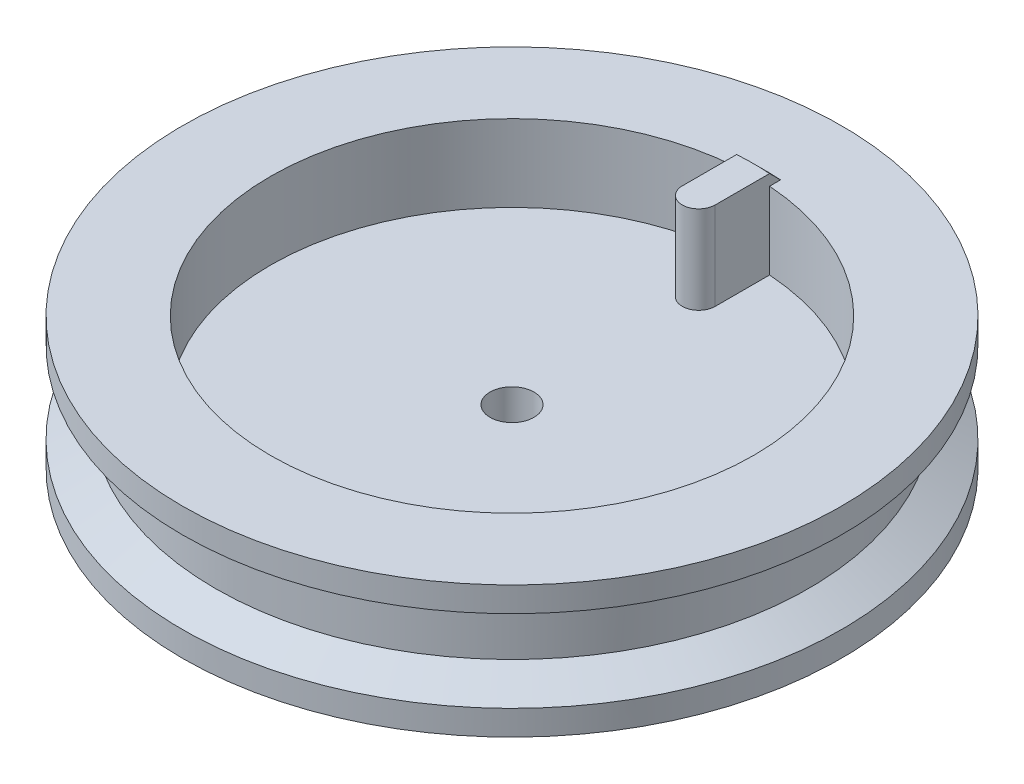
ISO-10303-21;
HEADER;
FILE_DESCRIPTION(('STEP AP214'),'2;1');
FILE_NAME('part.step','',(''),(''),'','','');
FILE_SCHEMA(('AUTOMOTIVE_DESIGN { 1 0 10303 214 1 1 1 1 }'));
ENDSEC;
DATA;
#1=APPLICATION_CONTEXT('core data for automotive mechanical design processes');
#2=APPLICATION_PROTOCOL_DEFINITION('international standard','automotive_design',2000,#1);
#3=PRODUCT_CONTEXT('',#1,'mechanical');
#4=PRODUCT('Part','Part','',(#3));
#5=PRODUCT_RELATED_PRODUCT_CATEGORY('part','',(#4));
#6=PRODUCT_DEFINITION_FORMATION('','',#4);
#7=PRODUCT_DEFINITION_CONTEXT('part definition',#1,'design');
#8=PRODUCT_DEFINITION('design','',#6,#7);
#9=PRODUCT_DEFINITION_SHAPE('','',#8);
#10=(LENGTH_UNIT() NAMED_UNIT(*) SI_UNIT(.MILLI.,.METRE.));
#11=(NAMED_UNIT(*) PLANE_ANGLE_UNIT() SI_UNIT($,.RADIAN.));
#12=(NAMED_UNIT(*) SI_UNIT($,.STERADIAN.) SOLID_ANGLE_UNIT());
#13=UNCERTAINTY_MEASURE_WITH_UNIT(LENGTH_MEASURE(1.E-05),#10,'distance_accuracy_value','');
#14=(GEOMETRIC_REPRESENTATION_CONTEXT(3) GLOBAL_UNCERTAINTY_ASSIGNED_CONTEXT((#13)) GLOBAL_UNIT_ASSIGNED_CONTEXT((#10,
#11,#12)) REPRESENTATION_CONTEXT('',''));
#15=CARTESIAN_POINT('',(0.,0.,0.));
#16=DIRECTION('',(0.,0.,1.));
#17=DIRECTION('',(1.,0.,0.));
#18=AXIS2_PLACEMENT_3D('',#15,#16,#17);
#19=CARTESIAN_POINT('',(0.,-62.2253967444162,0.));
#20=DIRECTION('',(0.,1.,0.));
#21=DIRECTION('',(0.,0.,1.));
#22=AXIS2_PLACEMENT_3D('',#19,#20,#21);
#23=CYLINDRICAL_SURFACE('',#22,22.);
#24=DIRECTION('',(0.,-1.,0.));
#25=VECTOR('',#24,1.);
#26=CARTESIAN_POINT('',(1.5,13.,-21.948804067648));
#27=LINE('',#26,#25);
#28=CARTESIAN_POINT('',(1.5,12.,-21.948804067648));
#29=VERTEX_POINT('',#28);
#30=CARTESIAN_POINT('',(1.5,5.,-21.948804067648));
#31=VERTEX_POINT('',#30);
#32=EDGE_CURVE('E119',#29,#31,#27,.T.);
#33=ORIENTED_EDGE('',*,*,#32,.T.);
#34=CARTESIAN_POINT('',(0.,5.,0.));
#35=DIRECTION('',(0.,1.,0.));
#36=DIRECTION('',(0.,0.,1.));
#37=AXIS2_PLACEMENT_3D('',#34,#35,#36);
#38=CIRCLE('',#37,22.);
#39=CARTESIAN_POINT('',(-1.5,5.,-21.948804067648));
#40=VERTEX_POINT('',#39);
#41=EDGE_CURVE('E155',#31,#40,#38,.F.);
#42=ORIENTED_EDGE('',*,*,#41,.T.);
#43=DIRECTION('',(0.,-1.,0.));
#44=VECTOR('',#43,1.);
#45=CARTESIAN_POINT('',(-1.5,13.,-21.948804067648));
#46=LINE('',#45,#44);
#47=CARTESIAN_POINT('',(-1.5,12.,-21.948804067648));
#48=VERTEX_POINT('',#47);
#49=EDGE_CURVE('E127',#48,#40,#46,.T.);
#50=ORIENTED_EDGE('',*,*,#49,.F.);
#51=CARTESIAN_POINT('',(0.,12.,0.));
#52=DIRECTION('',(0.,1.,0.));
#53=DIRECTION('',(0.,0.,1.));
#54=AXIS2_PLACEMENT_3D('',#51,#52,#53);
#55=CIRCLE('',#54,22.);
#56=EDGE_CURVE('E110',#48,#29,#55,.T.);
#57=ORIENTED_EDGE('',*,*,#56,.T.);
#58=EDGE_LOOP('',(#33,#42,#50,#57));
#59=FACE_BOUND('',#58,.T.);
#60=ADVANCED_FACE('F54',(#59),#23,.F.);
#61=CARTESIAN_POINT('',(0.,5.,0.));
#62=DIRECTION('',(0.,1.,0.));
#63=DIRECTION('',(0.,0.,1.));
#64=AXIS2_PLACEMENT_3D('',#61,#62,#63);
#65=PLANE('',#64);
#66=CARTESIAN_POINT('',(0.,5.,0.));
#67=DIRECTION('',(0.,1.,0.));
#68=DIRECTION('',(0.,0.,1.));
#69=AXIS2_PLACEMENT_3D('',#66,#67,#68);
#70=CIRCLE('',#69,2.);
#71=CARTESIAN_POINT('',(0.,5.,2.));
#72=VERTEX_POINT('',#71);
#73=EDGE_CURVE('E157',#72,#72,#70,.T.);
#74=ORIENTED_EDGE('',*,*,#73,.F.);
#75=EDGE_LOOP('',(#74));
#76=FACE_BOUND('',#75,.T.);
#77=ORIENTED_EDGE('',*,*,#41,.F.);
#78=DIRECTION('',(0.,0.,-1.));
#79=VECTOR('',#78,1.);
#80=CARTESIAN_POINT('',(1.5,5.,0.));
#81=LINE('',#80,#79);
#82=CARTESIAN_POINT('',(1.5,5.,-17.));
#83=VERTEX_POINT('',#82);
#84=EDGE_CURVE('E122',#83,#31,#81,.T.);
#85=ORIENTED_EDGE('',*,*,#84,.F.);
#86=CARTESIAN_POINT('',(0.,5.,-17.));
#87=DIRECTION('',(0.,1.,0.));
#88=DIRECTION('',(0.,0.,1.));
#89=AXIS2_PLACEMENT_3D('',#86,#87,#88);
#90=CIRCLE('',#89,1.5);
#91=CARTESIAN_POINT('',(-1.5,5.,-17.));
#92=VERTEX_POINT('',#91);
#93=EDGE_CURVE('E132',#83,#92,#90,.F.);
#94=ORIENTED_EDGE('',*,*,#93,.T.);
#95=DIRECTION('',(0.,0.,-1.));
#96=VECTOR('',#95,1.);
#97=CARTESIAN_POINT('',(-1.5,5.,0.));
#98=LINE('',#97,#96);
#99=EDGE_CURVE('E139',#92,#40,#98,.T.);
#100=ORIENTED_EDGE('',*,*,#99,.T.);
#101=EDGE_LOOP('',(#77,#85,#94,#100));
#102=FACE_BOUND('',#101,.T.);
#103=ADVANCED_FACE('F199',(#76,#102),#65,.T.);
#104=CARTESIAN_POINT('',(0.,2.,0.));
#105=DIRECTION('',(0.,-1.,0.));
#106=DIRECTION('',(0.,0.,-1.));
#107=AXIS2_PLACEMENT_3D('',#104,#105,#106);
#108=CYLINDRICAL_SURFACE('',#107,2.);
#109=CARTESIAN_POINT('',(0.,0.,0.));
#110=DIRECTION('',(0.,1.,0.));
#111=DIRECTION('',(0.,0.,1.));
#112=AXIS2_PLACEMENT_3D('',#109,#110,#111);
#113=CIRCLE('',#112,2.);
#114=CARTESIAN_POINT('',(0.,0.,2.));
#115=VERTEX_POINT('',#114);
#116=EDGE_CURVE('E116',#115,#115,#113,.T.);
#117=ORIENTED_EDGE('',*,*,#116,.F.);
#118=EDGE_LOOP('',(#117));
#119=FACE_BOUND('',#118,.T.);
#120=ORIENTED_EDGE('',*,*,#73,.T.);
#121=EDGE_LOOP('',(#120));
#122=FACE_BOUND('',#121,.T.);
#123=ADVANCED_FACE('F202',(#119,#122),#108,.F.);
#124=CARTESIAN_POINT('',(0.,2.,0.));
#125=DIRECTION('',(0.,-1.,0.));
#126=DIRECTION('',(0.,0.,-1.));
#127=AXIS2_PLACEMENT_3D('',#124,#125,#126);
#128=CYLINDRICAL_SURFACE('',#127,30.);
#129=CARTESIAN_POINT('',(0.,2.26794919243116,0.));
#130=DIRECTION('',(0.,-1.,0.));
#131=DIRECTION('',(0.,0.,-1.));
#132=AXIS2_PLACEMENT_3D('',#129,#130,#131);
#133=CIRCLE('',#132,30.);
#134=CARTESIAN_POINT('',(0.,2.26794919243116,-30.));
#135=VERTEX_POINT('',#134);
#136=EDGE_CURVE('E223',#135,#135,#133,.T.);
#137=ORIENTED_EDGE('',*,*,#136,.T.);
#138=EDGE_LOOP('',(#137));
#139=FACE_BOUND('',#138,.T.);
#140=CARTESIAN_POINT('',(0.,0.,0.));
#141=DIRECTION('',(0.,1.,0.));
#142=DIRECTION('',(0.,0.,1.));
#143=AXIS2_PLACEMENT_3D('',#140,#141,#142);
#144=CIRCLE('',#143,30.);
#145=CARTESIAN_POINT('',(0.,0.,30.));
#146=VERTEX_POINT('',#145);
#147=EDGE_CURVE('E158',#146,#146,#144,.T.);
#148=ORIENTED_EDGE('',*,*,#147,.T.);
#149=EDGE_LOOP('',(#148));
#150=FACE_BOUND('',#149,.T.);
#151=ADVANCED_FACE('F212',(#139,#150),#128,.T.);
#152=CARTESIAN_POINT('',(0.,0.,0.));
#153=DIRECTION('',(0.,1.,0.));
#154=DIRECTION('',(0.,0.,1.));
#155=AXIS2_PLACEMENT_3D('',#152,#153,#154);
#156=PLANE('',#155);
#157=ORIENTED_EDGE('',*,*,#147,.F.);
#158=EDGE_LOOP('',(#157));
#159=FACE_BOUND('',#158,.T.);
#160=ORIENTED_EDGE('',*,*,#116,.T.);
#161=EDGE_LOOP('',(#160));
#162=FACE_BOUND('',#161,.T.);
#163=ADVANCED_FACE('F208',(#159,#162),#156,.F.);
#164=CARTESIAN_POINT('',(0.,10.,0.));
#165=DIRECTION('',(0.,-1.,0.));
#166=DIRECTION('',(0.,0.,-1.));
#167=AXIS2_PLACEMENT_3D('',#164,#165,#166);
#168=CYLINDRICAL_SURFACE('',#167,27.);
#169=CARTESIAN_POINT('',(0.,7.99999999999998,0.));
#170=DIRECTION('',(0.,1.,0.));
#171=DIRECTION('',(0.,0.,1.));
#172=AXIS2_PLACEMENT_3D('',#169,#170,#171);
#173=CIRCLE('',#172,27.);
#174=CARTESIAN_POINT('',(0.,7.99999999999998,27.));
#175=VERTEX_POINT('',#174);
#176=EDGE_CURVE('E63',#175,#175,#173,.F.);
#177=ORIENTED_EDGE('',*,*,#176,.T.);
#178=EDGE_LOOP('',(#177));
#179=FACE_BOUND('',#178,.T.);
#180=CARTESIAN_POINT('',(0.,4.00000000000002,0.));
#181=DIRECTION('',(0.,1.,0.));
#182=DIRECTION('',(0.,0.,1.));
#183=AXIS2_PLACEMENT_3D('',#180,#181,#182);
#184=CIRCLE('',#183,27.);
#185=CARTESIAN_POINT('',(0.,4.00000000000002,27.));
#186=VERTEX_POINT('',#185);
#187=EDGE_CURVE('E238',#186,#186,#184,.T.);
#188=ORIENTED_EDGE('',*,*,#187,.T.);
#189=EDGE_LOOP('',(#188));
#190=FACE_BOUND('',#189,.T.);
#191=ADVANCED_FACE('F197',(#179,#190),#168,.T.);
#192=CARTESIAN_POINT('',(0.,13.,-17.));
#193=DIRECTION('',(0.,-1.,0.));
#194=DIRECTION('',(0.,0.,-1.));
#195=AXIS2_PLACEMENT_3D('',#192,#193,#194);
#196=CYLINDRICAL_SURFACE('',#195,1.5);
#197=ORIENTED_EDGE('',*,*,#93,.F.);
#198=DIRECTION('',(0.,-1.,0.));
#199=VECTOR('',#198,1.);
#200=CARTESIAN_POINT('',(1.5,13.,-17.));
#201=LINE('',#200,#199);
#202=CARTESIAN_POINT('',(1.5,13.,-17.));
#203=VERTEX_POINT('',#202);
#204=EDGE_CURVE('E126',#203,#83,#201,.T.);
#205=ORIENTED_EDGE('',*,*,#204,.F.);
#206=CARTESIAN_POINT('',(0.,13.,-17.));
#207=DIRECTION('',(0.,1.,0.));
#208=DIRECTION('',(0.,0.,1.));
#209=AXIS2_PLACEMENT_3D('',#206,#207,#208);
#210=CIRCLE('',#209,1.5);
#211=CARTESIAN_POINT('',(-1.5,13.,-17.));
#212=VERTEX_POINT('',#211);
#213=EDGE_CURVE('E135',#203,#212,#210,.F.);
#214=ORIENTED_EDGE('',*,*,#213,.T.);
#215=DIRECTION('',(0.,-1.,0.));
#216=VECTOR('',#215,1.);
#217=CARTESIAN_POINT('',(-1.5,13.,-17.));
#218=LINE('',#217,#216);
#219=EDGE_CURVE('E147',#212,#92,#218,.T.);
#220=ORIENTED_EDGE('',*,*,#219,.T.);
#221=EDGE_LOOP('',(#197,#205,#214,#220));
#222=FACE_BOUND('',#221,.T.);
#223=ADVANCED_FACE('F194',(#222),#196,.T.);
#224=CARTESIAN_POINT('',(1.5,13.,0.));
#225=DIRECTION('',(-1.,0.,0.));
#226=DIRECTION('',(0.,0.,1.));
#227=AXIS2_PLACEMENT_3D('',#224,#225,#226);
#228=PLANE('',#227);
#229=ORIENTED_EDGE('',*,*,#84,.T.);
#230=ORIENTED_EDGE('',*,*,#32,.F.);
#231=DIRECTION('',(0.,0.,1.));
#232=VECTOR('',#231,1.);
#233=CARTESIAN_POINT('',(1.5,12.,0.));
#234=LINE('',#233,#232);
#235=CARTESIAN_POINT('',(1.5,12.,-22.951034835057));
#236=VERTEX_POINT('',#235);
#237=EDGE_CURVE('E106',#236,#29,#234,.T.);
#238=ORIENTED_EDGE('',*,*,#237,.F.);
#239=CARTESIAN_POINT('',(1.5,12.,-22.951034835057));
#240=CARTESIAN_POINT('',(1.5,12.1666749564121,-22.7840046451209));
#241=CARTESIAN_POINT('',(1.5,12.3333457679504,-22.6169703195365));
#242=CARTESIAN_POINT('',(1.5,12.6666791012837,-22.2828933970668));
#243=CARTESIAN_POINT('',(1.5,12.8333416230788,-22.1158508001815));
#244=CARTESIAN_POINT('',(1.5,13.,-21.948804067648));
#245=B_SPLINE_CURVE_WITH_KNOTS('',3,(#239,#240,#241,#242,#243,#244),.UNSPECIFIED.,.F.,.F.,(4,2,
4),(0.,0.707895916134697,1.41579183228876),.UNSPECIFIED.);
#246=CARTESIAN_POINT('',(1.5,13.,-21.948804067648));
#247=VERTEX_POINT('',#246);
#248=EDGE_CURVE('E174',#236,#247,#245,.T.);
#249=ORIENTED_EDGE('',*,*,#248,.T.);
#250=DIRECTION('',(0.,0.,-1.));
#251=VECTOR('',#250,1.);
#252=CARTESIAN_POINT('',(1.5,13.,0.));
#253=LINE('',#252,#251);
#254=EDGE_CURVE('E138',#203,#247,#253,.T.);
#255=ORIENTED_EDGE('',*,*,#254,.F.);
#256=ORIENTED_EDGE('',*,*,#204,.T.);
#257=EDGE_LOOP('',(#229,#230,#238,#249,#255,#256));
#258=FACE_BOUND('',#257,.T.);
#259=ADVANCED_FACE('F120',(#258),#228,.F.);
#260=CARTESIAN_POINT('',(-1.5,13.,0.));
#261=DIRECTION('',(-1.,0.,0.));
#262=DIRECTION('',(0.,0.,1.));
#263=AXIS2_PLACEMENT_3D('',#260,#261,#262);
#264=PLANE('',#263);
#265=ORIENTED_EDGE('',*,*,#99,.F.);
#266=ORIENTED_EDGE('',*,*,#219,.F.);
#267=DIRECTION('',(0.,0.,-1.));
#268=VECTOR('',#267,1.);
#269=CARTESIAN_POINT('',(-1.5,13.,0.));
#270=LINE('',#269,#268);
#271=CARTESIAN_POINT('',(-1.5,13.,-21.948804067648));
#272=VERTEX_POINT('',#271);
#273=EDGE_CURVE('E145',#212,#272,#270,.T.);
#274=ORIENTED_EDGE('',*,*,#273,.T.);
#275=CARTESIAN_POINT('',(-1.5,13.,-21.948804067648));
#276=CARTESIAN_POINT('',(-1.5,12.8333416230788,-22.1158508001815));
#277=CARTESIAN_POINT('',(-1.5,12.6666791012837,-22.2828933970668));
#278=CARTESIAN_POINT('',(-1.5,12.3333457679504,-22.6169703195365));
#279=CARTESIAN_POINT('',(-1.5,12.1666749564121,-22.7840046451209));
#280=CARTESIAN_POINT('',(-1.5,12.,-22.951034835057));
#281=B_SPLINE_CURVE_WITH_KNOTS('',3,(#275,#276,#277,#278,#279,#280),.UNSPECIFIED.,.F.,.F.,(4,2,
4),(0.,0.707895916154066,1.41579183228876),.UNSPECIFIED.);
#282=CARTESIAN_POINT('',(-1.5,12.,-22.951034835057));
#283=VERTEX_POINT('',#282);
#284=EDGE_CURVE('E75',#272,#283,#281,.T.);
#285=ORIENTED_EDGE('',*,*,#284,.T.);
#286=DIRECTION('',(0.,0.,-1.));
#287=VECTOR('',#286,1.);
#288=CARTESIAN_POINT('',(-1.5,12.,0.));
#289=LINE('',#288,#287);
#290=EDGE_CURVE('E70',#48,#283,#289,.T.);
#291=ORIENTED_EDGE('',*,*,#290,.F.);
#292=ORIENTED_EDGE('',*,*,#49,.T.);
#293=EDGE_LOOP('',(#265,#266,#274,#285,#291,#292));
#294=FACE_BOUND('',#293,.T.);
#295=ADVANCED_FACE('F185',(#294),#264,.T.);
#296=CARTESIAN_POINT('',(0.,13.,0.));
#297=DIRECTION('',(0.,1.,0.));
#298=DIRECTION('',(0.,0.,1.));
#299=AXIS2_PLACEMENT_3D('',#296,#297,#298);
#300=PLANE('',#299);
#301=ORIENTED_EDGE('',*,*,#213,.F.);
#302=ORIENTED_EDGE('',*,*,#254,.T.);
#303=CARTESIAN_POINT('',(0.,13.,0.));
#304=DIRECTION('',(0.,1.,0.));
#305=DIRECTION('',(0.,0.,1.));
#306=AXIS2_PLACEMENT_3D('',#303,#304,#305);
#307=CIRCLE('',#306,22.);
#308=EDGE_CURVE('E142',#247,#272,#307,.T.);
#309=ORIENTED_EDGE('',*,*,#308,.T.);
#310=ORIENTED_EDGE('',*,*,#273,.F.);
#311=EDGE_LOOP('',(#301,#302,#309,#310));
#312=FACE_BOUND('',#311,.T.);
#313=ADVANCED_FACE('F189',(#312),#300,.T.);
#314=CARTESIAN_POINT('',(0.,12.,0.));
#315=DIRECTION('',(0.,1.,0.));
#316=DIRECTION('',(0.,0.,1.));
#317=AXIS2_PLACEMENT_3D('',#314,#315,#316);
#318=PLANE('',#317);
#319=CARTESIAN_POINT('',(0.,12.,0.));
#320=DIRECTION('',(0.,1.,0.));
#321=DIRECTION('',(0.,0.,1.));
#322=AXIS2_PLACEMENT_3D('',#319,#320,#321);
#323=CIRCLE('',#322,30.);
#324=CARTESIAN_POINT('',(0.,12.,30.));
#325=VERTEX_POINT('',#324);
#326=EDGE_CURVE('E129',#325,#325,#323,.T.);
#327=ORIENTED_EDGE('',*,*,#326,.T.);
#328=EDGE_LOOP('',(#327));
#329=FACE_BOUND('',#328,.T.);
#330=ORIENTED_EDGE('',*,*,#56,.F.);
#331=ORIENTED_EDGE('',*,*,#290,.T.);
#332=CARTESIAN_POINT('',(0.,12.,0.));
#333=DIRECTION('',(0.,1.,0.));
#334=DIRECTION('',(0.,0.,1.));
#335=AXIS2_PLACEMENT_3D('',#332,#333,#334);
#336=CIRCLE('',#335,23.);
#337=EDGE_CURVE('E113',#283,#236,#336,.F.);
#338=ORIENTED_EDGE('',*,*,#337,.T.);
#339=ORIENTED_EDGE('',*,*,#237,.T.);
#340=EDGE_LOOP('',(#330,#331,#338,#339));
#341=FACE_BOUND('',#340,.T.);
#342=ADVANCED_FACE('F108',(#329,#341),#318,.T.);
#343=CARTESIAN_POINT('',(0.,12.,0.));
#344=DIRECTION('',(0.,-1.,0.));
#345=DIRECTION('',(0.,0.,-1.));
#346=AXIS2_PLACEMENT_3D('',#343,#344,#345);
#347=CYLINDRICAL_SURFACE('',#346,30.);
#348=CARTESIAN_POINT('',(0.,9.73205080756884,0.));
#349=DIRECTION('',(0.,1.,0.));
#350=DIRECTION('',(0.,0.,1.));
#351=AXIS2_PLACEMENT_3D('',#348,#349,#350);
#352=CIRCLE('',#351,30.);
#353=CARTESIAN_POINT('',(0.,9.73205080756884,30.));
#354=VERTEX_POINT('',#353);
#355=EDGE_CURVE('E13',#354,#354,#352,.T.);
#356=ORIENTED_EDGE('',*,*,#355,.T.);
#357=EDGE_LOOP('',(#356));
#358=FACE_BOUND('',#357,.T.);
#359=ORIENTED_EDGE('',*,*,#326,.F.);
#360=EDGE_LOOP('',(#359));
#361=FACE_BOUND('',#360,.T.);
#362=ADVANCED_FACE('F251',(#358,#361),#347,.T.);
#363=CARTESIAN_POINT('',(0.,13.,0.));
#364=DIRECTION('',(0.,-1.,0.));
#365=DIRECTION('',(0.,0.,-1.));
#366=AXIS2_PLACEMENT_3D('',#363,#364,#365);
#367=CONICAL_SURFACE('',#366,22.,0.785398163397448);
#368=ORIENTED_EDGE('',*,*,#248,.F.);
#369=ORIENTED_EDGE('',*,*,#337,.F.);
#370=ORIENTED_EDGE('',*,*,#284,.F.);
#371=ORIENTED_EDGE('',*,*,#308,.F.);
#372=EDGE_LOOP('',(#368,#369,#370,#371));
#373=FACE_BOUND('',#372,.T.);
#374=ADVANCED_FACE('F182',(#373),#367,.T.);
#375=CARTESIAN_POINT('',(0.,4.00000000000002,0.));
#376=DIRECTION('',(0.,-1.,0.));
#377=DIRECTION('',(0.,0.,-1.));
#378=AXIS2_PLACEMENT_3D('',#375,#376,#377);
#379=CONICAL_SURFACE('',#378,27.,1.0471975511966);
#380=ORIENTED_EDGE('',*,*,#136,.F.);
#381=EDGE_LOOP('',(#380));
#382=FACE_BOUND('',#381,.T.);
#383=ORIENTED_EDGE('',*,*,#187,.F.);
#384=EDGE_LOOP('',(#383));
#385=FACE_BOUND('',#384,.T.);
#386=ADVANCED_FACE('F248',(#382,#385),#379,.T.);
#387=CARTESIAN_POINT('',(0.,10.,0.));
#388=DIRECTION('',(0.,1.,0.));
#389=DIRECTION('',(0.,0.,1.));
#390=AXIS2_PLACEMENT_3D('',#387,#388,#389);
#391=CONICAL_SURFACE('',#390,30.4641016151378,1.0471975511966);
#392=ORIENTED_EDGE('',*,*,#176,.F.);
#393=EDGE_LOOP('',(#392));
#394=FACE_BOUND('',#393,.T.);
#395=ORIENTED_EDGE('',*,*,#355,.F.);
#396=EDGE_LOOP('',(#395));
#397=FACE_BOUND('',#396,.T.);
#398=ADVANCED_FACE('F57',(#394,#397),#391,.T.);
#399=CLOSED_SHELL('',(#60,#103,#123,#151,#163,#191,#223,#259,#295,#313,#342,#362,#374,#386,#398));
#400=MANIFOLD_SOLID_BREP('B2',#399);
#401=ADVANCED_BREP_SHAPE_REPRESENTATION('',(#18,#400),#14);
#402=SHAPE_DEFINITION_REPRESENTATION(#9,#401);
ENDSEC;
END-ISO-10303-21;
